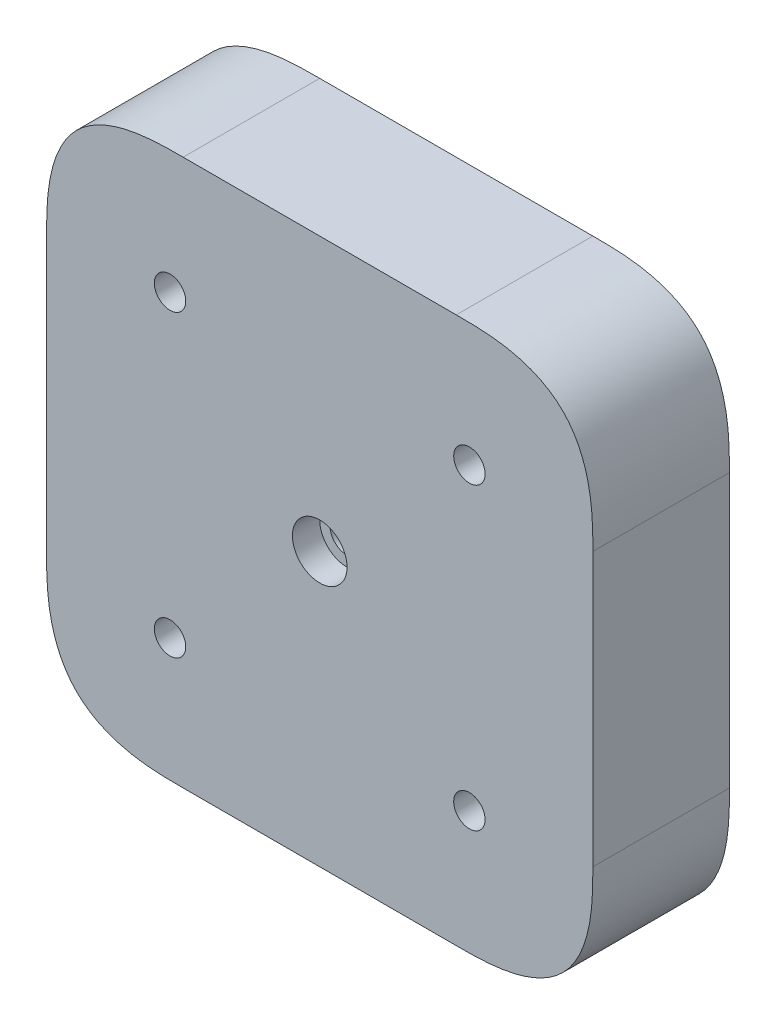
ISO-10303-21;
HEADER;
FILE_DESCRIPTION(('STEP AP214'),'2;1');
FILE_NAME('part.step','',(''),(''),'','','');
FILE_SCHEMA(('AUTOMOTIVE_DESIGN { 1 0 10303 214 1 1 1 1 }'));
ENDSEC;
DATA;
#1=APPLICATION_CONTEXT('core data for automotive mechanical design processes');
#2=APPLICATION_PROTOCOL_DEFINITION('international standard','automotive_design',2000,#1);
#3=PRODUCT_CONTEXT('',#1,'mechanical');
#4=PRODUCT('Part','Part','',(#3));
#5=PRODUCT_RELATED_PRODUCT_CATEGORY('part','',(#4));
#6=PRODUCT_DEFINITION_FORMATION('','',#4);
#7=PRODUCT_DEFINITION_CONTEXT('part definition',#1,'design');
#8=PRODUCT_DEFINITION('design','',#6,#7);
#9=PRODUCT_DEFINITION_SHAPE('','',#8);
#10=(LENGTH_UNIT() NAMED_UNIT(*) SI_UNIT(.MILLI.,.METRE.));
#11=(NAMED_UNIT(*) PLANE_ANGLE_UNIT() SI_UNIT($,.RADIAN.));
#12=(NAMED_UNIT(*) SI_UNIT($,.STERADIAN.) SOLID_ANGLE_UNIT());
#13=UNCERTAINTY_MEASURE_WITH_UNIT(LENGTH_MEASURE(1.E-05),#10,'distance_accuracy_value','');
#14=(GEOMETRIC_REPRESENTATION_CONTEXT(3) GLOBAL_UNCERTAINTY_ASSIGNED_CONTEXT((#13)) GLOBAL_UNIT_ASSIGNED_CONTEXT((#10,
#11,#12)) REPRESENTATION_CONTEXT('',''));
#15=CARTESIAN_POINT('',(0.,0.,0.));
#16=DIRECTION('',(0.,0.,1.));
#17=DIRECTION('',(1.,0.,0.));
#18=AXIS2_PLACEMENT_3D('',#15,#16,#17);
#19=CARTESIAN_POINT('',(9.03984489160851,30.9601551083915,10.001));
#20=DIRECTION('',(0.,0.,-1.));
#21=DIRECTION('',(-1.,0.,0.));
#22=AXIS2_PLACEMENT_3D('',#19,#20,#21);
#23=CYLINDRICAL_SURFACE('',#22,1.15);
#24=CARTESIAN_POINT('',(9.03984489160851,30.9601551083915,10.));
#25=DIRECTION('',(0.,0.,1.));
#26=DIRECTION('',(1.,0.,0.));
#27=AXIS2_PLACEMENT_3D('',#24,#25,#26);
#28=CIRCLE('',#27,1.15);
#29=CARTESIAN_POINT('',(10.1898448916085,30.9601551083915,10.));
#30=VERTEX_POINT('',#29);
#31=EDGE_CURVE('E276',#30,#30,#28,.F.);
#32=ORIENTED_EDGE('',*,*,#31,.F.);
#33=EDGE_LOOP('',(#32));
#34=FACE_BOUND('',#33,.T.);
#35=CARTESIAN_POINT('',(9.03984489160851,30.9601551083915,4.));
#36=DIRECTION('',(0.,0.,-1.));
#37=DIRECTION('',(-1.,0.,0.));
#38=AXIS2_PLACEMENT_3D('',#35,#36,#37);
#39=CIRCLE('',#38,1.15);
#40=CARTESIAN_POINT('',(7.88984489160851,30.9601551083915,4.));
#41=VERTEX_POINT('',#40);
#42=EDGE_CURVE('E298',#41,#41,#39,.T.);
#43=ORIENTED_EDGE('',*,*,#42,.T.);
#44=EDGE_LOOP('',(#43));
#45=FACE_BOUND('',#44,.T.);
#46=ADVANCED_FACE('F46',(#34,#45),#23,.F.);
#47=CARTESIAN_POINT('',(30.9601551083914,30.9601551083913,10.001));
#48=DIRECTION('',(0.,0.,-1.));
#49=DIRECTION('',(-1.,0.,0.));
#50=AXIS2_PLACEMENT_3D('',#47,#48,#49);
#51=CYLINDRICAL_SURFACE('',#50,1.15);
#52=CARTESIAN_POINT('',(30.9601551083914,30.9601551083913,10.));
#53=DIRECTION('',(0.,0.,1.));
#54=DIRECTION('',(1.,0.,0.));
#55=AXIS2_PLACEMENT_3D('',#52,#53,#54);
#56=CIRCLE('',#55,1.15);
#57=CARTESIAN_POINT('',(32.1101551083914,30.9601551083913,10.));
#58=VERTEX_POINT('',#57);
#59=EDGE_CURVE('E281',#58,#58,#56,.F.);
#60=ORIENTED_EDGE('',*,*,#59,.F.);
#61=EDGE_LOOP('',(#60));
#62=FACE_BOUND('',#61,.T.);
#63=CARTESIAN_POINT('',(30.9601551083914,30.9601551083913,4.));
#64=DIRECTION('',(0.,0.,-1.));
#65=DIRECTION('',(-1.,0.,0.));
#66=AXIS2_PLACEMENT_3D('',#63,#64,#65);
#67=CIRCLE('',#66,1.15);
#68=CARTESIAN_POINT('',(29.8101551083914,30.9601551083913,4.));
#69=VERTEX_POINT('',#68);
#70=EDGE_CURVE('E311',#69,#69,#67,.T.);
#71=ORIENTED_EDGE('',*,*,#70,.T.);
#72=EDGE_LOOP('',(#71));
#73=FACE_BOUND('',#72,.T.);
#74=ADVANCED_FACE('F379',(#62,#73),#51,.F.);
#75=CARTESIAN_POINT('',(30.9601551083913,9.0398448916083,10.001));
#76=DIRECTION('',(0.,0.,-1.));
#77=DIRECTION('',(-1.,0.,0.));
#78=AXIS2_PLACEMENT_3D('',#75,#76,#77);
#79=CYLINDRICAL_SURFACE('',#78,1.15);
#80=CARTESIAN_POINT('',(30.9601551083913,9.0398448916083,10.));
#81=DIRECTION('',(0.,0.,1.));
#82=DIRECTION('',(1.,0.,0.));
#83=AXIS2_PLACEMENT_3D('',#80,#81,#82);
#84=CIRCLE('',#83,1.15);
#85=CARTESIAN_POINT('',(32.1101551083913,9.0398448916083,10.));
#86=VERTEX_POINT('',#85);
#87=EDGE_CURVE('E286',#86,#86,#84,.F.);
#88=ORIENTED_EDGE('',*,*,#87,.F.);
#89=EDGE_LOOP('',(#88));
#90=FACE_BOUND('',#89,.T.);
#91=CARTESIAN_POINT('',(30.9601551083913,9.0398448916083,4.));
#92=DIRECTION('',(0.,0.,-1.));
#93=DIRECTION('',(-1.,0.,0.));
#94=AXIS2_PLACEMENT_3D('',#91,#92,#93);
#95=CIRCLE('',#94,1.15);
#96=CARTESIAN_POINT('',(29.8101551083913,9.0398448916083,4.));
#97=VERTEX_POINT('',#96);
#98=EDGE_CURVE('E315',#97,#97,#95,.T.);
#99=ORIENTED_EDGE('',*,*,#98,.T.);
#100=EDGE_LOOP('',(#99));
#101=FACE_BOUND('',#100,.T.);
#102=ADVANCED_FACE('F385',(#90,#101),#79,.F.);
#103=CARTESIAN_POINT('',(9.03984489160826,9.03984489160847,10.001));
#104=DIRECTION('',(0.,0.,-1.));
#105=DIRECTION('',(-1.,0.,0.));
#106=AXIS2_PLACEMENT_3D('',#103,#104,#105);
#107=CYLINDRICAL_SURFACE('',#106,1.15);
#108=CARTESIAN_POINT('',(9.03984489160826,9.03984489160847,10.));
#109=DIRECTION('',(0.,0.,1.));
#110=DIRECTION('',(1.,0.,0.));
#111=AXIS2_PLACEMENT_3D('',#108,#109,#110);
#112=CIRCLE('',#111,1.15);
#113=CARTESIAN_POINT('',(10.1898448916083,9.03984489160847,10.));
#114=VERTEX_POINT('',#113);
#115=EDGE_CURVE('E282',#114,#114,#112,.F.);
#116=ORIENTED_EDGE('',*,*,#115,.F.);
#117=EDGE_LOOP('',(#116));
#118=FACE_BOUND('',#117,.T.);
#119=CARTESIAN_POINT('',(9.03984489160826,9.03984489160847,4.));
#120=DIRECTION('',(0.,0.,-1.));
#121=DIRECTION('',(-1.,0.,0.));
#122=AXIS2_PLACEMENT_3D('',#119,#120,#121);
#123=CIRCLE('',#122,1.15);
#124=CARTESIAN_POINT('',(7.88984489160826,9.03984489160847,4.));
#125=VERTEX_POINT('',#124);
#126=EDGE_CURVE('E327',#125,#125,#123,.T.);
#127=ORIENTED_EDGE('',*,*,#126,.T.);
#128=EDGE_LOOP('',(#127));
#129=FACE_BOUND('',#128,.T.);
#130=ADVANCED_FACE('F342',(#118,#129),#107,.F.);
#131=CARTESIAN_POINT('',(0.,0.,10.));
#132=DIRECTION('',(0.,1.,0.));
#133=DIRECTION('',(0.,0.,1.));
#134=AXIS2_PLACEMENT_3D('',#131,#132,#133);
#135=PLANE('',#134);
#136=DIRECTION('',(1.,0.,0.));
#137=VECTOR('',#136,1.);
#138=CARTESIAN_POINT('',(0.,0.,10.));
#139=LINE('',#138,#137);
#140=CARTESIAN_POINT('',(10.,0.,10.));
#141=VERTEX_POINT('',#140);
#142=CARTESIAN_POINT('',(30.,0.,10.));
#143=VERTEX_POINT('',#142);
#144=EDGE_CURVE('E148',#141,#143,#139,.T.);
#145=ORIENTED_EDGE('',*,*,#144,.F.);
#146=CARTESIAN_POINT('',(10.,0.,-0.5));
#147=CARTESIAN_POINT('',(10.,0.,3.16666666666667));
#148=CARTESIAN_POINT('',(10.,0.,6.8333333333393));
#149=CARTESIAN_POINT('',(10.,0.,10.5));
#150=B_SPLINE_CURVE_WITH_KNOTS('',3,(#146,#147,#148,#149),.UNSPECIFIED.,.F.,.F.,(4,4),(-0.0105,
0.0005),.UNSPECIFIED.);
#151=CARTESIAN_POINT('',(10.,0.,0.));
#152=VERTEX_POINT('',#151);
#153=EDGE_CURVE('E126',#141,#152,#150,.F.);
#154=ORIENTED_EDGE('',*,*,#153,.T.);
#155=DIRECTION('',(1.,0.,0.));
#156=VECTOR('',#155,1.);
#157=CARTESIAN_POINT('',(0.,0.,0.));
#158=LINE('',#157,#156);
#159=CARTESIAN_POINT('',(30.,0.,0.));
#160=VERTEX_POINT('',#159);
#161=EDGE_CURVE('E145',#152,#160,#158,.T.);
#162=ORIENTED_EDGE('',*,*,#161,.T.);
#163=CARTESIAN_POINT('',(30.,0.,10.5));
#164=CARTESIAN_POINT('',(30.,0.,6.83333333332658));
#165=CARTESIAN_POINT('',(30.,0.,3.16666666666667));
#166=CARTESIAN_POINT('',(30.,0.,-0.5));
#167=B_SPLINE_CURVE_WITH_KNOTS('',3,(#163,#164,#165,#166),.UNSPECIFIED.,.F.,.F.,(4,4),(-0.0005,
0.0105),.UNSPECIFIED.);
#168=EDGE_CURVE('E151',#160,#143,#167,.F.);
#169=ORIENTED_EDGE('',*,*,#168,.T.);
#170=EDGE_LOOP('',(#145,#154,#162,#169));
#171=FACE_BOUND('',#170,.T.);
#172=ADVANCED_FACE('F144',(#171),#135,.F.);
#173=CARTESIAN_POINT('',(40.,0.,10.));
#174=DIRECTION('',(-1.,0.,0.));
#175=DIRECTION('',(0.,-1.,0.));
#176=AXIS2_PLACEMENT_3D('',#173,#174,#175);
#177=PLANE('',#176);
#178=DIRECTION('',(0.,1.,0.));
#179=VECTOR('',#178,1.);
#180=CARTESIAN_POINT('',(40.,0.,0.));
#181=LINE('',#180,#179);
#182=CARTESIAN_POINT('',(40.,10.,0.));
#183=VERTEX_POINT('',#182);
#184=CARTESIAN_POINT('',(40.,30.,0.));
#185=VERTEX_POINT('',#184);
#186=EDGE_CURVE('E159',#183,#185,#181,.T.);
#187=ORIENTED_EDGE('',*,*,#186,.T.);
#188=CARTESIAN_POINT('',(40.,30.,10.5));
#189=CARTESIAN_POINT('',(40.,30.,6.8333333333393));
#190=CARTESIAN_POINT('',(40.,30.,3.16666666666667));
#191=CARTESIAN_POINT('',(40.,30.,-0.5));
#192=B_SPLINE_CURVE_WITH_KNOTS('',3,(#188,#189,#190,#191),.UNSPECIFIED.,.F.,.F.,(4,4),(-0.0105,
0.0005),.UNSPECIFIED.);
#193=CARTESIAN_POINT('',(40.,30.,10.));
#194=VERTEX_POINT('',#193);
#195=EDGE_CURVE('E11',#185,#194,#192,.F.);
#196=ORIENTED_EDGE('',*,*,#195,.T.);
#197=DIRECTION('',(0.,1.,0.));
#198=VECTOR('',#197,1.);
#199=CARTESIAN_POINT('',(40.,0.,10.));
#200=LINE('',#199,#198);
#201=CARTESIAN_POINT('',(40.,10.,10.));
#202=VERTEX_POINT('',#201);
#203=EDGE_CURVE('E255',#202,#194,#200,.T.);
#204=ORIENTED_EDGE('',*,*,#203,.F.);
#205=CARTESIAN_POINT('',(40.,10.,-0.5));
#206=CARTESIAN_POINT('',(40.,10.,3.16666666666667));
#207=CARTESIAN_POINT('',(40.,10.,6.83333333332658));
#208=CARTESIAN_POINT('',(40.,10.,10.5));
#209=B_SPLINE_CURVE_WITH_KNOTS('',3,(#205,#206,#207,#208),.UNSPECIFIED.,.F.,.F.,(4,4),(-0.0005,
0.0105),.UNSPECIFIED.);
#210=EDGE_CURVE('E61',#202,#183,#209,.F.);
#211=ORIENTED_EDGE('',*,*,#210,.T.);
#212=EDGE_LOOP('',(#187,#196,#204,#211));
#213=FACE_BOUND('',#212,.T.);
#214=ADVANCED_FACE('F512',(#213),#177,.F.);
#215=CARTESIAN_POINT('',(0.,40.,10.));
#216=DIRECTION('',(0.,1.,0.));
#217=DIRECTION('',(0.,0.,1.));
#218=AXIS2_PLACEMENT_3D('',#215,#216,#217);
#219=PLANE('',#218);
#220=DIRECTION('',(1.,0.,0.));
#221=VECTOR('',#220,1.);
#222=CARTESIAN_POINT('',(0.,40.,0.));
#223=LINE('',#222,#221);
#224=CARTESIAN_POINT('',(9.99999999999999,40.,0.));
#225=VERTEX_POINT('',#224);
#226=CARTESIAN_POINT('',(30.,40.,0.));
#227=VERTEX_POINT('',#226);
#228=EDGE_CURVE('E165',#225,#227,#223,.T.);
#229=ORIENTED_EDGE('',*,*,#228,.F.);
#230=CARTESIAN_POINT('',(9.99999999999999,40.,10.5));
#231=CARTESIAN_POINT('',(9.99999999999999,40.,6.83333333332658));
#232=CARTESIAN_POINT('',(9.99999999999999,40.,3.16666666666667));
#233=CARTESIAN_POINT('',(9.99999999999999,40.,-0.5));
#234=B_SPLINE_CURVE_WITH_KNOTS('',3,(#230,#231,#232,#233),.UNSPECIFIED.,.F.,.F.,(4,4),(-0.0005,
0.0105),.UNSPECIFIED.);
#235=CARTESIAN_POINT('',(9.99999999999999,40.,10.));
#236=VERTEX_POINT('',#235);
#237=EDGE_CURVE('E76',#225,#236,#234,.F.);
#238=ORIENTED_EDGE('',*,*,#237,.T.);
#239=DIRECTION('',(1.,0.,0.));
#240=VECTOR('',#239,1.);
#241=CARTESIAN_POINT('',(0.,40.,10.));
#242=LINE('',#241,#240);
#243=CARTESIAN_POINT('',(30.,40.,10.));
#244=VERTEX_POINT('',#243);
#245=EDGE_CURVE('E237',#236,#244,#242,.T.);
#246=ORIENTED_EDGE('',*,*,#245,.T.);
#247=CARTESIAN_POINT('',(30.,40.,-0.5));
#248=CARTESIAN_POINT('',(30.,40.,3.16666666666667));
#249=CARTESIAN_POINT('',(30.,40.,6.8333333333393));
#250=CARTESIAN_POINT('',(30.,40.,10.5));
#251=B_SPLINE_CURVE_WITH_KNOTS('',3,(#247,#248,#249,#250),.UNSPECIFIED.,.F.,.F.,(4,4),(-0.0105,
0.0005),.UNSPECIFIED.);
#252=EDGE_CURVE('E498',#244,#227,#251,.F.);
#253=ORIENTED_EDGE('',*,*,#252,.T.);
#254=EDGE_LOOP('',(#229,#238,#246,#253));
#255=FACE_BOUND('',#254,.T.);
#256=ADVANCED_FACE('F521',(#255),#219,.T.);
#257=CARTESIAN_POINT('',(20.,20.,10.));
#258=DIRECTION('',(0.,0.,-1.));
#259=DIRECTION('',(-1.,0.,0.));
#260=AXIS2_PLACEMENT_3D('',#257,#258,#259);
#261=CYLINDRICAL_SURFACE('',#260,2.);
#262=CARTESIAN_POINT('',(20.,20.,8.));
#263=DIRECTION('',(0.,0.,1.));
#264=DIRECTION('',(1.,0.,0.));
#265=AXIS2_PLACEMENT_3D('',#262,#263,#264);
#266=CIRCLE('',#265,2.);
#267=CARTESIAN_POINT('',(22.,20.,8.));
#268=VERTEX_POINT('',#267);
#269=EDGE_CURVE('E173',#268,#268,#266,.T.);
#270=ORIENTED_EDGE('',*,*,#269,.F.);
#271=EDGE_LOOP('',(#270));
#272=FACE_BOUND('',#271,.T.);
#273=CARTESIAN_POINT('',(20.,20.,10.));
#274=DIRECTION('',(0.,0.,1.));
#275=DIRECTION('',(1.,0.,0.));
#276=AXIS2_PLACEMENT_3D('',#273,#274,#275);
#277=CIRCLE('',#276,2.);
#278=CARTESIAN_POINT('',(22.,20.,10.));
#279=VERTEX_POINT('',#278);
#280=EDGE_CURVE('E269',#279,#279,#277,.T.);
#281=ORIENTED_EDGE('',*,*,#280,.T.);
#282=EDGE_LOOP('',(#281));
#283=FACE_BOUND('',#282,.T.);
#284=ADVANCED_FACE('F575',(#272,#283),#261,.F.);
#285=CARTESIAN_POINT('',(0.,0.,10.));
#286=DIRECTION('',(-1.,0.,0.));
#287=DIRECTION('',(0.,-1.,0.));
#288=AXIS2_PLACEMENT_3D('',#285,#286,#287);
#289=PLANE('',#288);
#290=DIRECTION('',(0.,1.,0.));
#291=VECTOR('',#290,1.);
#292=CARTESIAN_POINT('',(0.,0.,0.));
#293=LINE('',#292,#291);
#294=CARTESIAN_POINT('',(0.,10.,0.));
#295=VERTEX_POINT('',#294);
#296=CARTESIAN_POINT('',(0.,30.,0.));
#297=VERTEX_POINT('',#296);
#298=EDGE_CURVE('E273',#295,#297,#293,.T.);
#299=ORIENTED_EDGE('',*,*,#298,.F.);
#300=CARTESIAN_POINT('',(0.,10.,10.5));
#301=CARTESIAN_POINT('',(0.,10.,6.8333333333393));
#302=CARTESIAN_POINT('',(0.,10.,3.16666666666667));
#303=CARTESIAN_POINT('',(0.,10.,-0.5));
#304=B_SPLINE_CURVE_WITH_KNOTS('',3,(#300,#301,#302,#303),.UNSPECIFIED.,.F.,.F.,(4,4),(-0.0105,
0.0005),.UNSPECIFIED.);
#305=CARTESIAN_POINT('',(0.,10.,10.));
#306=VERTEX_POINT('',#305);
#307=EDGE_CURVE('E128',#295,#306,#304,.F.);
#308=ORIENTED_EDGE('',*,*,#307,.T.);
#309=DIRECTION('',(0.,1.,0.));
#310=VECTOR('',#309,1.);
#311=CARTESIAN_POINT('',(0.,0.,10.));
#312=LINE('',#311,#310);
#313=CARTESIAN_POINT('',(0.,30.,10.));
#314=VERTEX_POINT('',#313);
#315=EDGE_CURVE('E228',#306,#314,#312,.T.);
#316=ORIENTED_EDGE('',*,*,#315,.T.);
#317=CARTESIAN_POINT('',(0.,30.,-0.5));
#318=CARTESIAN_POINT('',(0.,30.,3.16666666666667));
#319=CARTESIAN_POINT('',(0.,30.,6.83333333332658));
#320=CARTESIAN_POINT('',(0.,30.,10.5));
#321=B_SPLINE_CURVE_WITH_KNOTS('',3,(#317,#318,#319,#320),.UNSPECIFIED.,.F.,.F.,(4,4),(-0.0005,
0.0105),.UNSPECIFIED.);
#322=EDGE_CURVE('E136',#314,#297,#321,.F.);
#323=ORIENTED_EDGE('',*,*,#322,.T.);
#324=EDGE_LOOP('',(#299,#308,#316,#323));
#325=FACE_BOUND('',#324,.T.);
#326=ADVANCED_FACE('F207',(#325),#289,.T.);
#327=CARTESIAN_POINT('',(0.,0.,10.));
#328=DIRECTION('',(0.,0.,1.));
#329=DIRECTION('',(1.,0.,0.));
#330=AXIS2_PLACEMENT_3D('',#327,#328,#329);
#331=PLANE('',#330);
#332=ORIENTED_EDGE('',*,*,#115,.T.);
#333=EDGE_LOOP('',(#332));
#334=FACE_BOUND('',#333,.T.);
#335=ORIENTED_EDGE('',*,*,#87,.T.);
#336=EDGE_LOOP('',(#335));
#337=FACE_BOUND('',#336,.T.);
#338=ORIENTED_EDGE('',*,*,#59,.T.);
#339=EDGE_LOOP('',(#338));
#340=FACE_BOUND('',#339,.T.);
#341=ORIENTED_EDGE('',*,*,#31,.T.);
#342=EDGE_LOOP('',(#341));
#343=FACE_BOUND('',#342,.T.);
#344=ORIENTED_EDGE('',*,*,#280,.F.);
#345=EDGE_LOOP('',(#344));
#346=FACE_BOUND('',#345,.T.);
#347=ORIENTED_EDGE('',*,*,#315,.F.);
#348=CARTESIAN_POINT('',(10.,0.,10.));
#349=CARTESIAN_POINT('',(8.31801948466054,0.,10.));
#350=CARTESIAN_POINT('',(6.63603896932107,0.,10.));
#351=CARTESIAN_POINT('',(2.92893218813452,0.716919198360833,10.));
#352=CARTESIAN_POINT('',(0.716919198360834,2.92893218813452,10.));
#353=CARTESIAN_POINT('',(0.,6.63603896932107,10.));
#354=CARTESIAN_POINT('',(0.,8.31801948466054,10.));
#355=CARTESIAN_POINT('',(0.,10.,10.));
#356=B_SPLINE_CURVE_WITH_KNOTS('',5,(#348,#349,#350,#351,#352,#353,#354,#355),.UNSPECIFIED.,.F.,
.F.,(6,2,6),(0.,0.5,1.),.UNSPECIFIED.);
#357=EDGE_CURVE('E412',#306,#141,#356,.F.);
#358=ORIENTED_EDGE('',*,*,#357,.T.);
#359=ORIENTED_EDGE('',*,*,#144,.T.);
#360=CARTESIAN_POINT('',(40.,10.,10.));
#361=CARTESIAN_POINT('',(40.,8.31801948466054,10.));
#362=CARTESIAN_POINT('',(40.,6.63603896932107,10.));
#363=CARTESIAN_POINT('',(39.2830808016392,2.92893218813453,10.));
#364=CARTESIAN_POINT('',(37.0710678118655,0.716919198360835,10.));
#365=CARTESIAN_POINT('',(33.3639610306789,0.,10.));
#366=CARTESIAN_POINT('',(31.6819805153395,0.,10.));
#367=CARTESIAN_POINT('',(30.,0.,10.));
#368=B_SPLINE_CURVE_WITH_KNOTS('',5,(#360,#361,#362,#363,#364,#365,#366,#367),.UNSPECIFIED.,.F.,
.F.,(6,2,6),(0.,0.5,1.),.UNSPECIFIED.);
#369=EDGE_CURVE('E410',#143,#202,#368,.F.);
#370=ORIENTED_EDGE('',*,*,#369,.T.);
#371=ORIENTED_EDGE('',*,*,#203,.T.);
#372=CARTESIAN_POINT('',(30.,40.,10.));
#373=CARTESIAN_POINT('',(31.6819805153395,40.,10.));
#374=CARTESIAN_POINT('',(33.3639610306789,40.,10.));
#375=CARTESIAN_POINT('',(37.0710678118655,39.2830808016392,10.));
#376=CARTESIAN_POINT('',(39.2830808016392,37.0710678118655,10.));
#377=CARTESIAN_POINT('',(40.,33.3639610306789,10.));
#378=CARTESIAN_POINT('',(40.,31.6819805153395,10.));
#379=CARTESIAN_POINT('',(40.,30.,10.));
#380=B_SPLINE_CURVE_WITH_KNOTS('',5,(#372,#373,#374,#375,#376,#377,#378,#379),.UNSPECIFIED.,.F.,
.F.,(6,2,6),(0.,0.5,1.),.UNSPECIFIED.);
#381=EDGE_CURVE('E68',#194,#244,#380,.F.);
#382=ORIENTED_EDGE('',*,*,#381,.T.);
#383=ORIENTED_EDGE('',*,*,#245,.F.);
#384=CARTESIAN_POINT('',(0.,30.,10.));
#385=CARTESIAN_POINT('',(0.,31.6819805153395,10.));
#386=CARTESIAN_POINT('',(0.,33.3639610306789,10.));
#387=CARTESIAN_POINT('',(0.716919198360828,37.0710678118655,10.));
#388=CARTESIAN_POINT('',(2.92893218813452,39.2830808016391,10.));
#389=CARTESIAN_POINT('',(6.63603896932106,40.,10.));
#390=CARTESIAN_POINT('',(8.31801948466053,40.,10.));
#391=CARTESIAN_POINT('',(9.99999999999999,40.,10.));
#392=B_SPLINE_CURVE_WITH_KNOTS('',5,(#384,#385,#386,#387,#388,#389,#390,#391),.UNSPECIFIED.,.F.,
.F.,(6,2,6),(0.,0.5,1.),.UNSPECIFIED.);
#393=EDGE_CURVE('E500',#236,#314,#392,.F.);
#394=ORIENTED_EDGE('',*,*,#393,.T.);
#395=EDGE_LOOP('',(#347,#358,#359,#370,#371,#382,#383,#394));
#396=FACE_BOUND('',#395,.T.);
#397=ADVANCED_FACE('F203',(#334,#337,#340,#343,#346,#396),#331,.T.);
#398=CARTESIAN_POINT('',(0.,0.,0.));
#399=DIRECTION('',(0.,0.,1.));
#400=DIRECTION('',(1.,0.,0.));
#401=AXIS2_PLACEMENT_3D('',#398,#399,#400);
#402=PLANE('',#401);
#403=CARTESIAN_POINT('',(30.9601551083914,30.9601551083913,0.));
#404=DIRECTION('',(0.,0.,-1.));
#405=DIRECTION('',(-1.,0.,0.));
#406=AXIS2_PLACEMENT_3D('',#403,#404,#405);
#407=CIRCLE('',#406,3.);
#408=CARTESIAN_POINT('',(27.9601551083914,30.9601551083913,0.));
#409=VERTEX_POINT('',#408);
#410=EDGE_CURVE('E306',#409,#409,#407,.T.);
#411=ORIENTED_EDGE('',*,*,#410,.F.);
#412=EDGE_LOOP('',(#411));
#413=FACE_BOUND('',#412,.T.);
#414=CARTESIAN_POINT('',(30.9601551083913,9.0398448916083,0.));
#415=DIRECTION('',(0.,0.,-1.));
#416=DIRECTION('',(-1.,0.,0.));
#417=AXIS2_PLACEMENT_3D('',#414,#415,#416);
#418=CIRCLE('',#417,3.);
#419=CARTESIAN_POINT('',(27.9601551083913,9.0398448916083,0.));
#420=VERTEX_POINT('',#419);
#421=EDGE_CURVE('E319',#420,#420,#418,.T.);
#422=ORIENTED_EDGE('',*,*,#421,.F.);
#423=EDGE_LOOP('',(#422));
#424=FACE_BOUND('',#423,.T.);
#425=CARTESIAN_POINT('',(9.03984489160826,9.03984489160847,0.));
#426=DIRECTION('',(0.,0.,-1.));
#427=DIRECTION('',(-1.,0.,0.));
#428=AXIS2_PLACEMENT_3D('',#425,#426,#427);
#429=CIRCLE('',#428,3.);
#430=CARTESIAN_POINT('',(6.03984489160826,9.03984489160847,0.));
#431=VERTEX_POINT('',#430);
#432=EDGE_CURVE('E331',#431,#431,#429,.T.);
#433=ORIENTED_EDGE('',*,*,#432,.F.);
#434=EDGE_LOOP('',(#433));
#435=FACE_BOUND('',#434,.T.);
#436=CARTESIAN_POINT('',(9.03984489160851,30.9601551083915,0.));
#437=DIRECTION('',(0.,0.,-1.));
#438=DIRECTION('',(-1.,0.,0.));
#439=AXIS2_PLACEMENT_3D('',#436,#437,#438);
#440=CIRCLE('',#439,3.);
#441=CARTESIAN_POINT('',(6.03984489160851,30.9601551083915,0.));
#442=VERTEX_POINT('',#441);
#443=EDGE_CURVE('E294',#442,#442,#440,.T.);
#444=ORIENTED_EDGE('',*,*,#443,.F.);
#445=EDGE_LOOP('',(#444));
#446=FACE_BOUND('',#445,.T.);
#447=ORIENTED_EDGE('',*,*,#161,.F.);
#448=CARTESIAN_POINT('',(0.,10.,0.));
#449=CARTESIAN_POINT('',(0.,8.31801948466054,0.));
#450=CARTESIAN_POINT('',(0.,6.63603896932107,0.));
#451=CARTESIAN_POINT('',(0.716919198360834,2.92893218813452,0.));
#452=CARTESIAN_POINT('',(2.92893218813452,0.716919198360833,0.));
#453=CARTESIAN_POINT('',(6.63603896932107,0.,0.));
#454=CARTESIAN_POINT('',(8.31801948466054,0.,0.));
#455=CARTESIAN_POINT('',(10.,0.,0.));
#456=B_SPLINE_CURVE_WITH_KNOTS('',5,(#448,#449,#450,#451,#452,#453,#454,#455),.UNSPECIFIED.,.F.,
.F.,(6,2,6),(0.,0.5,1.),.UNSPECIFIED.);
#457=EDGE_CURVE('E121',#152,#295,#456,.F.);
#458=ORIENTED_EDGE('',*,*,#457,.T.);
#459=ORIENTED_EDGE('',*,*,#298,.T.);
#460=CARTESIAN_POINT('',(9.99999999999999,40.,0.));
#461=CARTESIAN_POINT('',(8.31801948466053,40.,0.));
#462=CARTESIAN_POINT('',(6.63603896932106,40.,0.));
#463=CARTESIAN_POINT('',(2.92893218813452,39.2830808016392,0.));
#464=CARTESIAN_POINT('',(0.716919198360829,37.0710678118655,0.));
#465=CARTESIAN_POINT('',(0.,33.3639610306789,0.));
#466=CARTESIAN_POINT('',(0.,31.6819805153395,0.));
#467=CARTESIAN_POINT('',(0.,30.,0.));
#468=B_SPLINE_CURVE_WITH_KNOTS('',5,(#460,#461,#462,#463,#464,#465,#466,#467),.UNSPECIFIED.,.F.,
.F.,(6,2,6),(0.,0.5,1.),.UNSPECIFIED.);
#469=EDGE_CURVE('E137',#297,#225,#468,.F.);
#470=ORIENTED_EDGE('',*,*,#469,.T.);
#471=ORIENTED_EDGE('',*,*,#228,.T.);
#472=CARTESIAN_POINT('',(40.,30.,0.));
#473=CARTESIAN_POINT('',(40.,31.6819805153395,0.));
#474=CARTESIAN_POINT('',(40.,33.3639610306789,0.));
#475=CARTESIAN_POINT('',(39.2830808016392,37.0710678118655,0.));
#476=CARTESIAN_POINT('',(37.0710678118655,39.2830808016392,0.));
#477=CARTESIAN_POINT('',(33.3639610306789,40.,0.));
#478=CARTESIAN_POINT('',(31.6819805153395,40.,0.));
#479=CARTESIAN_POINT('',(30.,40.,0.));
#480=B_SPLINE_CURVE_WITH_KNOTS('',5,(#472,#473,#474,#475,#476,#477,#478,#479),.UNSPECIFIED.,.F.,
.F.,(6,2,6),(0.,0.5,1.),.UNSPECIFIED.);
#481=EDGE_CURVE('E515',#227,#185,#480,.F.);
#482=ORIENTED_EDGE('',*,*,#481,.T.);
#483=ORIENTED_EDGE('',*,*,#186,.F.);
#484=CARTESIAN_POINT('',(30.,0.,0.));
#485=CARTESIAN_POINT('',(31.6819805153395,0.,0.));
#486=CARTESIAN_POINT('',(33.3639610306789,0.,0.));
#487=CARTESIAN_POINT('',(37.0710678118655,0.716919198360835,0.));
#488=CARTESIAN_POINT('',(39.2830808016392,2.92893218813453,0.));
#489=CARTESIAN_POINT('',(40.,6.63603896932107,0.));
#490=CARTESIAN_POINT('',(40.,8.31801948466054,0.));
#491=CARTESIAN_POINT('',(40.,10.,0.));
#492=B_SPLINE_CURVE_WITH_KNOTS('',5,(#484,#485,#486,#487,#488,#489,#490,#491),.UNSPECIFIED.,.F.,
.F.,(6,2,6),(0.,0.5,1.),.UNSPECIFIED.);
#493=EDGE_CURVE('E150',#183,#160,#492,.F.);
#494=ORIENTED_EDGE('',*,*,#493,.T.);
#495=EDGE_LOOP('',(#447,#458,#459,#470,#471,#482,#483,#494));
#496=FACE_BOUND('',#495,.T.);
#497=CARTESIAN_POINT('',(20.,20.,0.));
#498=DIRECTION('',(0.,0.,1.));
#499=DIRECTION('',(1.,0.,0.));
#500=AXIS2_PLACEMENT_3D('',#497,#498,#499);
#501=CIRCLE('',#500,1.25);
#502=CARTESIAN_POINT('',(21.25,20.,0.));
#503=VERTEX_POINT('',#502);
#504=EDGE_CURVE('E168',#503,#503,#501,.T.);
#505=ORIENTED_EDGE('',*,*,#504,.T.);
#506=EDGE_LOOP('',(#505));
#507=FACE_BOUND('',#506,.T.);
#508=ADVANCED_FACE('F154',(#413,#424,#435,#446,#496,#507),#402,.F.);
#509=CARTESIAN_POINT('',(20.,20.,8.));
#510=DIRECTION('',(0.,0.,-1.));
#511=DIRECTION('',(-1.,0.,0.));
#512=AXIS2_PLACEMENT_3D('',#509,#510,#511);
#513=CYLINDRICAL_SURFACE('',#512,1.25);
#514=CARTESIAN_POINT('',(20.,20.,8.));
#515=DIRECTION('',(0.,0.,1.));
#516=DIRECTION('',(1.,0.,0.));
#517=AXIS2_PLACEMENT_3D('',#514,#515,#516);
#518=CIRCLE('',#517,1.25);
#519=CARTESIAN_POINT('',(21.25,20.,8.));
#520=VERTEX_POINT('',#519);
#521=EDGE_CURVE('E160',#520,#520,#518,.T.);
#522=ORIENTED_EDGE('',*,*,#521,.T.);
#523=EDGE_LOOP('',(#522));
#524=FACE_BOUND('',#523,.T.);
#525=ORIENTED_EDGE('',*,*,#504,.F.);
#526=EDGE_LOOP('',(#525));
#527=FACE_BOUND('',#526,.T.);
#528=ADVANCED_FACE('F202',(#524,#527),#513,.F.);
#529=CARTESIAN_POINT('',(0.,0.,8.));
#530=DIRECTION('',(0.,0.,1.));
#531=DIRECTION('',(1.,0.,0.));
#532=AXIS2_PLACEMENT_3D('',#529,#530,#531);
#533=PLANE('',#532);
#534=ORIENTED_EDGE('',*,*,#521,.F.);
#535=EDGE_LOOP('',(#534));
#536=FACE_BOUND('',#535,.T.);
#537=ORIENTED_EDGE('',*,*,#269,.T.);
#538=EDGE_LOOP('',(#537));
#539=FACE_BOUND('',#538,.T.);
#540=ADVANCED_FACE('F354',(#536,#539),#533,.T.);
#541=CARTESIAN_POINT('',(9.03984489160826,9.03984489160847,4.));
#542=DIRECTION('',(0.,0.,-1.));
#543=DIRECTION('',(-1.,0.,0.));
#544=AXIS2_PLACEMENT_3D('',#541,#542,#543);
#545=CYLINDRICAL_SURFACE('',#544,3.);
#546=CARTESIAN_POINT('',(9.03984489160826,9.03984489160847,4.));
#547=DIRECTION('',(0.,0.,-1.));
#548=DIRECTION('',(-1.,0.,0.));
#549=AXIS2_PLACEMENT_3D('',#546,#547,#548);
#550=CIRCLE('',#549,3.);
#551=CARTESIAN_POINT('',(6.03984489160826,9.03984489160847,4.));
#552=VERTEX_POINT('',#551);
#553=EDGE_CURVE('E305',#552,#552,#550,.T.);
#554=ORIENTED_EDGE('',*,*,#553,.F.);
#555=EDGE_LOOP('',(#554));
#556=FACE_BOUND('',#555,.T.);
#557=ORIENTED_EDGE('',*,*,#432,.T.);
#558=EDGE_LOOP('',(#557));
#559=FACE_BOUND('',#558,.T.);
#560=ADVANCED_FACE('F348',(#556,#559),#545,.F.);
#561=CARTESIAN_POINT('',(9.03984489160826,9.03984489160847,4.));
#562=DIRECTION('',(0.,0.,-1.));
#563=DIRECTION('',(-1.,0.,0.));
#564=AXIS2_PLACEMENT_3D('',#561,#562,#563);
#565=PLANE('',#564);
#566=ORIENTED_EDGE('',*,*,#126,.F.);
#567=EDGE_LOOP('',(#566));
#568=FACE_BOUND('',#567,.T.);
#569=ORIENTED_EDGE('',*,*,#553,.T.);
#570=EDGE_LOOP('',(#569));
#571=FACE_BOUND('',#570,.T.);
#572=ADVANCED_FACE('F344',(#568,#571),#565,.T.);
#573=CARTESIAN_POINT('',(30.9601551083913,9.0398448916083,4.));
#574=DIRECTION('',(0.,0.,-1.));
#575=DIRECTION('',(-1.,0.,0.));
#576=AXIS2_PLACEMENT_3D('',#573,#574,#575);
#577=CYLINDRICAL_SURFACE('',#576,3.);
#578=CARTESIAN_POINT('',(30.9601551083913,9.0398448916083,4.));
#579=DIRECTION('',(0.,0.,-1.));
#580=DIRECTION('',(-1.,0.,0.));
#581=AXIS2_PLACEMENT_3D('',#578,#579,#580);
#582=CIRCLE('',#581,3.);
#583=CARTESIAN_POINT('',(27.9601551083913,9.0398448916083,4.));
#584=VERTEX_POINT('',#583);
#585=EDGE_CURVE('E323',#584,#584,#582,.T.);
#586=ORIENTED_EDGE('',*,*,#585,.F.);
#587=EDGE_LOOP('',(#586));
#588=FACE_BOUND('',#587,.T.);
#589=ORIENTED_EDGE('',*,*,#421,.T.);
#590=EDGE_LOOP('',(#589));
#591=FACE_BOUND('',#590,.T.);
#592=ADVANCED_FACE('F347',(#588,#591),#577,.F.);
#593=CARTESIAN_POINT('',(30.9601551083913,9.0398448916083,4.));
#594=DIRECTION('',(0.,0.,-1.));
#595=DIRECTION('',(-1.,0.,0.));
#596=AXIS2_PLACEMENT_3D('',#593,#594,#595);
#597=PLANE('',#596);
#598=ORIENTED_EDGE('',*,*,#98,.F.);
#599=EDGE_LOOP('',(#598));
#600=FACE_BOUND('',#599,.T.);
#601=ORIENTED_EDGE('',*,*,#585,.T.);
#602=EDGE_LOOP('',(#601));
#603=FACE_BOUND('',#602,.T.);
#604=ADVANCED_FACE('F774',(#600,#603),#597,.T.);
#605=CARTESIAN_POINT('',(30.9601551083914,30.9601551083913,4.));
#606=DIRECTION('',(0.,0.,-1.));
#607=DIRECTION('',(-1.,0.,0.));
#608=AXIS2_PLACEMENT_3D('',#605,#606,#607);
#609=CYLINDRICAL_SURFACE('',#608,3.);
#610=CARTESIAN_POINT('',(30.9601551083914,30.9601551083913,4.));
#611=DIRECTION('',(0.,0.,-1.));
#612=DIRECTION('',(-1.,0.,0.));
#613=AXIS2_PLACEMENT_3D('',#610,#611,#612);
#614=CIRCLE('',#613,3.);
#615=CARTESIAN_POINT('',(27.9601551083914,30.9601551083913,4.));
#616=VERTEX_POINT('',#615);
#617=EDGE_CURVE('E310',#616,#616,#614,.T.);
#618=ORIENTED_EDGE('',*,*,#617,.F.);
#619=EDGE_LOOP('',(#618));
#620=FACE_BOUND('',#619,.T.);
#621=ORIENTED_EDGE('',*,*,#410,.T.);
#622=EDGE_LOOP('',(#621));
#623=FACE_BOUND('',#622,.T.);
#624=ADVANCED_FACE('F373',(#620,#623),#609,.F.);
#625=CARTESIAN_POINT('',(30.9601551083914,30.9601551083913,4.));
#626=DIRECTION('',(0.,0.,-1.));
#627=DIRECTION('',(-1.,0.,0.));
#628=AXIS2_PLACEMENT_3D('',#625,#626,#627);
#629=PLANE('',#628);
#630=ORIENTED_EDGE('',*,*,#70,.F.);
#631=EDGE_LOOP('',(#630));
#632=FACE_BOUND('',#631,.T.);
#633=ORIENTED_EDGE('',*,*,#617,.T.);
#634=EDGE_LOOP('',(#633));
#635=FACE_BOUND('',#634,.T.);
#636=ADVANCED_FACE('F364',(#632,#635),#629,.T.);
#637=CARTESIAN_POINT('',(9.03984489160851,30.9601551083915,4.));
#638=DIRECTION('',(0.,0.,-1.));
#639=DIRECTION('',(-1.,0.,0.));
#640=AXIS2_PLACEMENT_3D('',#637,#638,#639);
#641=CYLINDRICAL_SURFACE('',#640,3.);
#642=CARTESIAN_POINT('',(9.03984489160851,30.9601551083915,4.));
#643=DIRECTION('',(0.,0.,-1.));
#644=DIRECTION('',(-1.,0.,0.));
#645=AXIS2_PLACEMENT_3D('',#642,#643,#644);
#646=CIRCLE('',#645,3.);
#647=CARTESIAN_POINT('',(6.03984489160851,30.9601551083915,4.));
#648=VERTEX_POINT('',#647);
#649=EDGE_CURVE('E287',#648,#648,#646,.T.);
#650=ORIENTED_EDGE('',*,*,#649,.F.);
#651=EDGE_LOOP('',(#650));
#652=FACE_BOUND('',#651,.T.);
#653=ORIENTED_EDGE('',*,*,#443,.T.);
#654=EDGE_LOOP('',(#653));
#655=FACE_BOUND('',#654,.T.);
#656=ADVANCED_FACE('F361',(#652,#655),#641,.F.);
#657=CARTESIAN_POINT('',(9.03984489160851,30.9601551083915,4.));
#658=DIRECTION('',(0.,0.,-1.));
#659=DIRECTION('',(-1.,0.,0.));
#660=AXIS2_PLACEMENT_3D('',#657,#658,#659);
#661=PLANE('',#660);
#662=ORIENTED_EDGE('',*,*,#42,.F.);
#663=EDGE_LOOP('',(#662));
#664=FACE_BOUND('',#663,.T.);
#665=ORIENTED_EDGE('',*,*,#649,.T.);
#666=EDGE_LOOP('',(#665));
#667=FACE_BOUND('',#666,.T.);
#668=ADVANCED_FACE('F363',(#664,#667),#661,.T.);
#669=CARTESIAN_POINT('',(0.,10.,-0.5));
#670=CARTESIAN_POINT('',(0.,10.,3.16666666666667));
#671=CARTESIAN_POINT('',(0.,10.,6.8333333333393));
#672=CARTESIAN_POINT('',(0.,10.,10.5));
#673=CARTESIAN_POINT('',(0.,8.31801948466054,-0.5));
#674=CARTESIAN_POINT('',(0.,8.31801948466054,3.16666666666667));
#675=CARTESIAN_POINT('',(0.,8.31801948466054,6.8333333333393));
#676=CARTESIAN_POINT('',(0.,8.31801948466054,10.5));
#677=CARTESIAN_POINT('',(0.,6.63603896932107,-0.5));
#678=CARTESIAN_POINT('',(0.,6.63603896932107,3.16666666666667));
#679=CARTESIAN_POINT('',(0.,6.63603896932107,6.8333333333393));
#680=CARTESIAN_POINT('',(0.,6.63603896932107,10.5));
#681=CARTESIAN_POINT('',(0.716919198360834,2.92893218813452,-0.5));
#682=CARTESIAN_POINT('',(0.716919198360834,2.92893218813452,3.16666666666667));
#683=CARTESIAN_POINT('',(0.716919198360834,2.92893218813452,6.8333333333393));
#684=CARTESIAN_POINT('',(0.716919198360834,2.92893218813452,10.5));
#685=CARTESIAN_POINT('',(2.92893218813452,0.716919198360833,-0.5));
#686=CARTESIAN_POINT('',(2.92893218813452,0.716919198360833,3.16666666666667));
#687=CARTESIAN_POINT('',(2.92893218813452,0.716919198360833,6.8333333333393));
#688=CARTESIAN_POINT('',(2.92893218813452,0.716919198360833,10.5));
#689=CARTESIAN_POINT('',(6.63603896932107,0.,-0.5));
#690=CARTESIAN_POINT('',(6.63603896932107,0.,3.16666666666667));
#691=CARTESIAN_POINT('',(6.63603896932107,0.,6.8333333333393));
#692=CARTESIAN_POINT('',(6.63603896932107,0.,10.5));
#693=CARTESIAN_POINT('',(8.31801948466054,0.,-0.5));
#694=CARTESIAN_POINT('',(8.31801948466054,0.,3.16666666666667));
#695=CARTESIAN_POINT('',(8.31801948466054,0.,6.8333333333393));
#696=CARTESIAN_POINT('',(8.31801948466054,0.,10.5));
#697=CARTESIAN_POINT('',(10.,0.,-0.5));
#698=CARTESIAN_POINT('',(10.,0.,3.16666666666667));
#699=CARTESIAN_POINT('',(10.,0.,6.8333333333393));
#700=CARTESIAN_POINT('',(10.,0.,10.5));
#701=B_SPLINE_SURFACE_WITH_KNOTS('',5,3,((#669,#670,#671,#672),(#673,#674,#675,#676),(#677,#678,
#679,#680),(#681,#682,#683,#684),(#685,#686,#687,#688),(#689,#690,#691,#692),(#693,#694,#695,
#696),(#697,#698,#699,#700)),.UNSPECIFIED.,.F.,.F.,.F.,(6,2,6),(4,4),(0.,0.5,1.),(-0.0105,
0.0005),.UNSPECIFIED.);
#702=ORIENTED_EDGE('',*,*,#357,.F.);
#703=ORIENTED_EDGE('',*,*,#307,.F.);
#704=ORIENTED_EDGE('',*,*,#457,.F.);
#705=ORIENTED_EDGE('',*,*,#153,.F.);
#706=EDGE_LOOP('',(#702,#703,#704,#705));
#707=FACE_BOUND('',#706,.T.);
#708=ADVANCED_FACE('F125',(#707),#701,.T.);
#709=CARTESIAN_POINT('',(0.,30.,10.5));
#710=CARTESIAN_POINT('',(0.,30.,6.83333333332658));
#711=CARTESIAN_POINT('',(0.,30.,3.16666666666667));
#712=CARTESIAN_POINT('',(0.,30.,-0.5));
#713=CARTESIAN_POINT('',(0.,31.6819805153395,10.5));
#714=CARTESIAN_POINT('',(0.,31.6819805153395,6.83333333332658));
#715=CARTESIAN_POINT('',(0.,31.6819805153395,3.16666666666667));
#716=CARTESIAN_POINT('',(0.,31.6819805153395,-0.5));
#717=CARTESIAN_POINT('',(0.,33.3639610306789,10.5));
#718=CARTESIAN_POINT('',(0.,33.3639610306789,6.83333333332658));
#719=CARTESIAN_POINT('',(0.,33.3639610306789,3.16666666666667));
#720=CARTESIAN_POINT('',(0.,33.3639610306789,-0.5));
#721=CARTESIAN_POINT('',(0.716919198360829,37.0710678118655,10.5));
#722=CARTESIAN_POINT('',(0.716919198360829,37.0710678118655,6.83333333332658));
#723=CARTESIAN_POINT('',(0.716919198360829,37.0710678118655,3.16666666666667));
#724=CARTESIAN_POINT('',(0.716919198360829,37.0710678118655,-0.5));
#725=CARTESIAN_POINT('',(2.92893218813452,39.2830808016392,10.5));
#726=CARTESIAN_POINT('',(2.92893218813452,39.2830808016392,6.83333333332658));
#727=CARTESIAN_POINT('',(2.92893218813452,39.2830808016392,3.16666666666667));
#728=CARTESIAN_POINT('',(2.92893218813452,39.2830808016392,-0.5));
#729=CARTESIAN_POINT('',(6.63603896932106,40.,10.5));
#730=CARTESIAN_POINT('',(6.63603896932106,40.,6.83333333332658));
#731=CARTESIAN_POINT('',(6.63603896932106,40.,3.16666666666667));
#732=CARTESIAN_POINT('',(6.63603896932106,40.,-0.5));
#733=CARTESIAN_POINT('',(8.31801948466053,40.,10.5));
#734=CARTESIAN_POINT('',(8.31801948466053,40.,6.83333333332658));
#735=CARTESIAN_POINT('',(8.31801948466053,40.,3.16666666666667));
#736=CARTESIAN_POINT('',(8.31801948466053,40.,-0.5));
#737=CARTESIAN_POINT('',(9.99999999999999,40.,10.5));
#738=CARTESIAN_POINT('',(9.99999999999999,40.,6.83333333332658));
#739=CARTESIAN_POINT('',(9.99999999999999,40.,3.16666666666667));
#740=CARTESIAN_POINT('',(9.99999999999999,40.,-0.5));
#741=B_SPLINE_SURFACE_WITH_KNOTS('',5,3,((#709,#710,#711,#712),(#713,#714,#715,#716),(#717,#718,
#719,#720),(#721,#722,#723,#724),(#725,#726,#727,#728),(#729,#730,#731,#732),(#733,#734,#735,
#736),(#737,#738,#739,#740)),.UNSPECIFIED.,.F.,.F.,.F.,(6,2,6),(4,4),(0.,0.5,1.),(-0.0005,
0.0105),.UNSPECIFIED.);
#742=ORIENTED_EDGE('',*,*,#393,.F.);
#743=ORIENTED_EDGE('',*,*,#237,.F.);
#744=ORIENTED_EDGE('',*,*,#469,.F.);
#745=ORIENTED_EDGE('',*,*,#322,.F.);
#746=EDGE_LOOP('',(#742,#743,#744,#745));
#747=FACE_BOUND('',#746,.T.);
#748=ADVANCED_FACE('F466',(#747),#741,.T.);
#749=CARTESIAN_POINT('',(40.,30.,-0.5));
#750=CARTESIAN_POINT('',(40.,30.,3.16666666666667));
#751=CARTESIAN_POINT('',(40.,30.,6.8333333333393));
#752=CARTESIAN_POINT('',(40.,30.,10.5));
#753=CARTESIAN_POINT('',(40.,31.6819805153395,-0.5));
#754=CARTESIAN_POINT('',(40.,31.6819805153395,3.16666666666667));
#755=CARTESIAN_POINT('',(40.,31.6819805153395,6.8333333333393));
#756=CARTESIAN_POINT('',(40.,31.6819805153395,10.5));
#757=CARTESIAN_POINT('',(40.,33.3639610306789,-0.5));
#758=CARTESIAN_POINT('',(40.,33.3639610306789,3.16666666666667));
#759=CARTESIAN_POINT('',(40.,33.3639610306789,6.8333333333393));
#760=CARTESIAN_POINT('',(40.,33.3639610306789,10.5));
#761=CARTESIAN_POINT('',(39.2830808016392,37.0710678118655,-0.5));
#762=CARTESIAN_POINT('',(39.2830808016392,37.0710678118655,3.16666666666667));
#763=CARTESIAN_POINT('',(39.2830808016392,37.0710678118655,6.8333333333393));
#764=CARTESIAN_POINT('',(39.2830808016392,37.0710678118655,10.5));
#765=CARTESIAN_POINT('',(37.0710678118655,39.2830808016392,-0.5));
#766=CARTESIAN_POINT('',(37.0710678118655,39.2830808016392,3.16666666666667));
#767=CARTESIAN_POINT('',(37.0710678118655,39.2830808016392,6.8333333333393));
#768=CARTESIAN_POINT('',(37.0710678118655,39.2830808016392,10.5));
#769=CARTESIAN_POINT('',(33.3639610306789,40.,-0.5));
#770=CARTESIAN_POINT('',(33.3639610306789,40.,3.16666666666667));
#771=CARTESIAN_POINT('',(33.3639610306789,40.,6.8333333333393));
#772=CARTESIAN_POINT('',(33.3639610306789,40.,10.5));
#773=CARTESIAN_POINT('',(31.6819805153395,40.,-0.5));
#774=CARTESIAN_POINT('',(31.6819805153395,40.,3.16666666666667));
#775=CARTESIAN_POINT('',(31.6819805153395,40.,6.8333333333393));
#776=CARTESIAN_POINT('',(31.6819805153395,40.,10.5));
#777=CARTESIAN_POINT('',(30.,40.,-0.5));
#778=CARTESIAN_POINT('',(30.,40.,3.16666666666667));
#779=CARTESIAN_POINT('',(30.,40.,6.8333333333393));
#780=CARTESIAN_POINT('',(30.,40.,10.5));
#781=B_SPLINE_SURFACE_WITH_KNOTS('',5,3,((#749,#750,#751,#752),(#753,#754,#755,#756),(#757,#758,
#759,#760),(#761,#762,#763,#764),(#765,#766,#767,#768),(#769,#770,#771,#772),(#773,#774,#775,
#776),(#777,#778,#779,#780)),.UNSPECIFIED.,.F.,.F.,.F.,(6,2,6),(4,4),(0.,0.5,1.),(-0.0105,
0.0005),.UNSPECIFIED.);
#782=ORIENTED_EDGE('',*,*,#381,.F.);
#783=ORIENTED_EDGE('',*,*,#195,.F.);
#784=ORIENTED_EDGE('',*,*,#481,.F.);
#785=ORIENTED_EDGE('',*,*,#252,.F.);
#786=EDGE_LOOP('',(#782,#783,#784,#785));
#787=FACE_BOUND('',#786,.T.);
#788=ADVANCED_FACE('F452',(#787),#781,.T.);
#789=CARTESIAN_POINT('',(40.,10.,10.5));
#790=CARTESIAN_POINT('',(40.,10.,6.83333333332658));
#791=CARTESIAN_POINT('',(40.,10.,3.16666666666667));
#792=CARTESIAN_POINT('',(40.,10.,-0.5));
#793=CARTESIAN_POINT('',(40.,8.31801948466054,10.5));
#794=CARTESIAN_POINT('',(40.,8.31801948466054,6.83333333332658));
#795=CARTESIAN_POINT('',(40.,8.31801948466054,3.16666666666667));
#796=CARTESIAN_POINT('',(40.,8.31801948466054,-0.5));
#797=CARTESIAN_POINT('',(40.,6.63603896932107,10.5));
#798=CARTESIAN_POINT('',(40.,6.63603896932107,6.83333333332658));
#799=CARTESIAN_POINT('',(40.,6.63603896932107,3.16666666666667));
#800=CARTESIAN_POINT('',(40.,6.63603896932107,-0.5));
#801=CARTESIAN_POINT('',(39.2830808016392,2.92893218813453,10.5));
#802=CARTESIAN_POINT('',(39.2830808016392,2.92893218813453,6.83333333332658));
#803=CARTESIAN_POINT('',(39.2830808016392,2.92893218813453,3.16666666666667));
#804=CARTESIAN_POINT('',(39.2830808016392,2.92893218813453,-0.5));
#805=CARTESIAN_POINT('',(37.0710678118655,0.716919198360835,10.5));
#806=CARTESIAN_POINT('',(37.0710678118655,0.716919198360835,6.83333333332658));
#807=CARTESIAN_POINT('',(37.0710678118655,0.716919198360835,3.16666666666667));
#808=CARTESIAN_POINT('',(37.0710678118655,0.716919198360835,-0.5));
#809=CARTESIAN_POINT('',(33.3639610306789,0.,10.5));
#810=CARTESIAN_POINT('',(33.3639610306789,0.,6.83333333332658));
#811=CARTESIAN_POINT('',(33.3639610306789,0.,3.16666666666667));
#812=CARTESIAN_POINT('',(33.3639610306789,0.,-0.5));
#813=CARTESIAN_POINT('',(31.6819805153395,0.,10.5));
#814=CARTESIAN_POINT('',(31.6819805153395,0.,6.83333333332658));
#815=CARTESIAN_POINT('',(31.6819805153395,0.,3.16666666666667));
#816=CARTESIAN_POINT('',(31.6819805153395,0.,-0.5));
#817=CARTESIAN_POINT('',(30.,0.,10.5));
#818=CARTESIAN_POINT('',(30.,0.,6.83333333332658));
#819=CARTESIAN_POINT('',(30.,0.,3.16666666666667));
#820=CARTESIAN_POINT('',(30.,0.,-0.5));
#821=B_SPLINE_SURFACE_WITH_KNOTS('',5,3,((#789,#790,#791,#792),(#793,#794,#795,#796),(#797,#798,
#799,#800),(#801,#802,#803,#804),(#805,#806,#807,#808),(#809,#810,#811,#812),(#813,#814,#815,
#816),(#817,#818,#819,#820)),.UNSPECIFIED.,.F.,.F.,.F.,(6,2,6),(4,4),(0.,0.5,1.),(-0.0005,
0.0105),.UNSPECIFIED.);
#822=ORIENTED_EDGE('',*,*,#369,.F.);
#823=ORIENTED_EDGE('',*,*,#168,.F.);
#824=ORIENTED_EDGE('',*,*,#493,.F.);
#825=ORIENTED_EDGE('',*,*,#210,.F.);
#826=EDGE_LOOP('',(#822,#823,#824,#825));
#827=FACE_BOUND('',#826,.T.);
#828=ADVANCED_FACE('F49',(#827),#821,.T.);
#829=CLOSED_SHELL('',(#46,#74,#102,#130,#172,#214,#256,#284,#326,#397,#508,#528,#540,#560,#572,
#592,#604,#624,#636,#656,#668,#708,#748,#788,#828));
#830=MANIFOLD_SOLID_BREP('B2',#829);
#831=ADVANCED_BREP_SHAPE_REPRESENTATION('',(#18,#830),#14);
#832=SHAPE_DEFINITION_REPRESENTATION(#9,#831);
ENDSEC;
END-ISO-10303-21;
